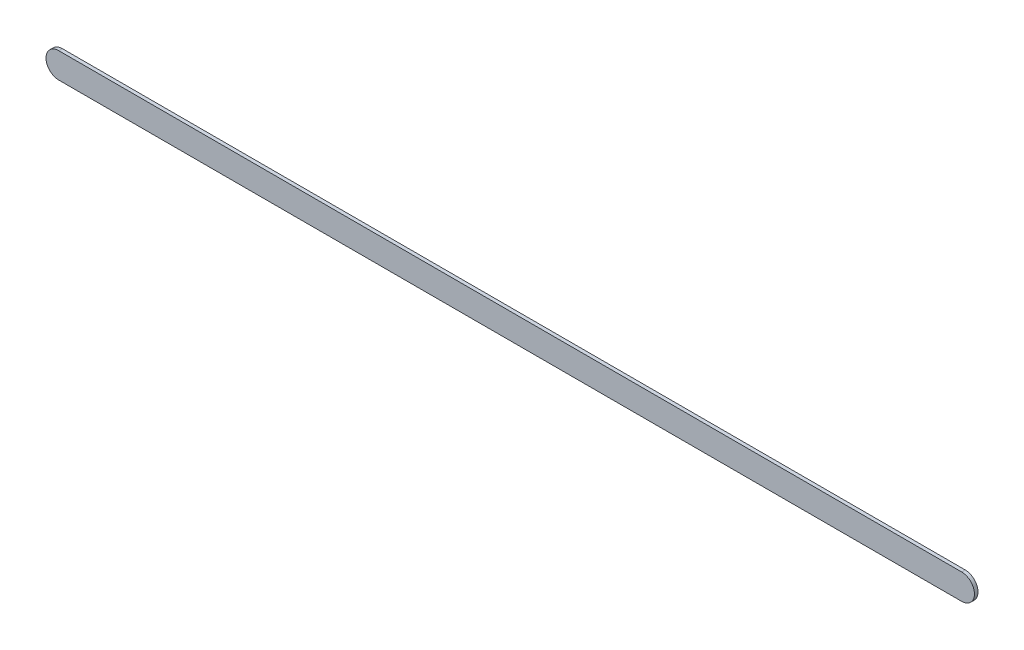
ISO-10303-21;
HEADER;
FILE_DESCRIPTION(('STEP AP214'),'2;1');
FILE_NAME('part.step','',(''),(''),'','','');
FILE_SCHEMA(('AUTOMOTIVE_DESIGN { 1 0 10303 214 1 1 1 1 }'));
ENDSEC;
DATA;
#1=APPLICATION_CONTEXT('core data for automotive mechanical design processes');
#2=APPLICATION_PROTOCOL_DEFINITION('international standard','automotive_design',2000,#1);
#3=PRODUCT_CONTEXT('',#1,'mechanical');
#4=PRODUCT('Part','Part','',(#3));
#5=PRODUCT_RELATED_PRODUCT_CATEGORY('part','',(#4));
#6=PRODUCT_DEFINITION_FORMATION('','',#4);
#7=PRODUCT_DEFINITION_CONTEXT('part definition',#1,'design');
#8=PRODUCT_DEFINITION('design','',#6,#7);
#9=PRODUCT_DEFINITION_SHAPE('','',#8);
#10=(LENGTH_UNIT() NAMED_UNIT(*) SI_UNIT(.MILLI.,.METRE.));
#11=(NAMED_UNIT(*) PLANE_ANGLE_UNIT() SI_UNIT($,.RADIAN.));
#12=(NAMED_UNIT(*) SI_UNIT($,.STERADIAN.) SOLID_ANGLE_UNIT());
#13=UNCERTAINTY_MEASURE_WITH_UNIT(LENGTH_MEASURE(1.E-05),#10,'distance_accuracy_value','');
#14=(GEOMETRIC_REPRESENTATION_CONTEXT(3) GLOBAL_UNCERTAINTY_ASSIGNED_CONTEXT((#13)) GLOBAL_UNIT_ASSIGNED_CONTEXT((#10,
#11,#12)) REPRESENTATION_CONTEXT('',''));
#15=CARTESIAN_POINT('',(0.,0.,0.));
#16=DIRECTION('',(0.,0.,1.));
#17=DIRECTION('',(1.,0.,0.));
#18=AXIS2_PLACEMENT_3D('',#15,#16,#17);
#19=CARTESIAN_POINT('',(76.61697402,94.75997304,0.));
#20=DIRECTION('',(0.,1.,0.));
#21=DIRECTION('',(1.,0.,0.));
#22=AXIS2_PLACEMENT_3D('',#19,#20,#21);
#23=PLANE('',#22);
#24=DIRECTION('',(1.,0.,0.));
#25=VECTOR('',#24,1.);
#26=CARTESIAN_POINT('',(76.61697402,94.75997304,0.03556));
#27=LINE('',#26,#25);
#28=CARTESIAN_POINT('',(76.61697402,94.75997304,0.03556));
#29=VERTEX_POINT('',#28);
#30=CARTESIAN_POINT('',(85.62479192,94.75997304,0.03556));
#31=VERTEX_POINT('',#30);
#32=EDGE_CURVE('E11',#29,#31,#27,.T.);
#33=ORIENTED_EDGE('',*,*,#32,.F.);
#34=DIRECTION('',(0.,0.,1.));
#35=VECTOR('',#34,1.);
#36=CARTESIAN_POINT('',(76.61697402,94.75997304,0.));
#37=LINE('',#36,#35);
#38=CARTESIAN_POINT('',(76.61697402,94.75997304,0.));
#39=VERTEX_POINT('',#38);
#40=EDGE_CURVE('E24',#39,#29,#37,.T.);
#41=ORIENTED_EDGE('',*,*,#40,.F.);
#42=DIRECTION('',(1.,0.,0.));
#43=VECTOR('',#42,1.);
#44=CARTESIAN_POINT('',(76.61697402,94.75997304,0.));
#45=LINE('',#44,#43);
#46=CARTESIAN_POINT('',(85.62479192,94.75997304,0.));
#47=VERTEX_POINT('',#46);
#48=EDGE_CURVE('E75',#39,#47,#45,.T.);
#49=ORIENTED_EDGE('',*,*,#48,.T.);
#50=DIRECTION('',(0.,0.,1.));
#51=VECTOR('',#50,1.);
#52=CARTESIAN_POINT('',(85.62479192,94.75997304,0.));
#53=LINE('',#52,#51);
#54=EDGE_CURVE('E37',#47,#31,#53,.T.);
#55=ORIENTED_EDGE('',*,*,#54,.T.);
#56=EDGE_LOOP('',(#33,#41,#49,#55));
#57=FACE_BOUND('',#56,.T.);
#58=ADVANCED_FACE('F17',(#57),#23,.F.);
#59=CARTESIAN_POINT('',(85.62479192,94.88697304,0.));
#60=DIRECTION('',(0.,0.,-1.));
#61=DIRECTION('',(-1.11896493820492E-13,-1.,0.));
#62=AXIS2_PLACEMENT_3D('',#59,#60,#61);
#63=CYLINDRICAL_SURFACE('',#62,0.126999999999991);
#64=CARTESIAN_POINT('',(85.62479192,94.88697304,0.03556));
#65=DIRECTION('',(0.,0.,1.));
#66=DIRECTION('',(-1.11896493820492E-13,-1.,0.));
#67=AXIS2_PLACEMENT_3D('',#64,#65,#66);
#68=CIRCLE('',#67,0.126999999999991);
#69=CARTESIAN_POINT('',(85.62479192,95.01397304,0.03556));
#70=VERTEX_POINT('',#69);
#71=EDGE_CURVE('E83',#31,#70,#68,.T.);
#72=ORIENTED_EDGE('',*,*,#71,.F.);
#73=ORIENTED_EDGE('',*,*,#54,.F.);
#74=CARTESIAN_POINT('',(85.62479192,94.88697304,0.));
#75=DIRECTION('',(0.,0.,1.));
#76=DIRECTION('',(-1.11896493820492E-13,-1.,0.));
#77=AXIS2_PLACEMENT_3D('',#74,#75,#76);
#78=CIRCLE('',#77,0.126999999999991);
#79=CARTESIAN_POINT('',(85.62479192,95.01397304,0.));
#80=VERTEX_POINT('',#79);
#81=EDGE_CURVE('E81',#47,#80,#78,.T.);
#82=ORIENTED_EDGE('',*,*,#81,.T.);
#83=DIRECTION('',(0.,0.,1.));
#84=VECTOR('',#83,1.);
#85=CARTESIAN_POINT('',(85.62479192,95.01397304,0.));
#86=LINE('',#85,#84);
#87=EDGE_CURVE('E67',#80,#70,#86,.T.);
#88=ORIENTED_EDGE('',*,*,#87,.T.);
#89=EDGE_LOOP('',(#72,#73,#82,#88));
#90=FACE_BOUND('',#89,.T.);
#91=ADVANCED_FACE('F89',(#90),#63,.T.);
#92=CARTESIAN_POINT('',(85.62479192,95.01397304,0.));
#93=DIRECTION('',(0.,-1.,0.));
#94=DIRECTION('',(-1.,0.,0.));
#95=AXIS2_PLACEMENT_3D('',#92,#93,#94);
#96=PLANE('',#95);
#97=DIRECTION('',(-1.,0.,0.));
#98=VECTOR('',#97,1.);
#99=CARTESIAN_POINT('',(85.62479192,95.01397304,0.03556));
#100=LINE('',#99,#98);
#101=CARTESIAN_POINT('',(76.61697402,95.01397304,0.03556));
#102=VERTEX_POINT('',#101);
#103=EDGE_CURVE('E71',#70,#102,#100,.T.);
#104=ORIENTED_EDGE('',*,*,#103,.F.);
#105=ORIENTED_EDGE('',*,*,#87,.F.);
#106=DIRECTION('',(-1.,0.,0.));
#107=VECTOR('',#106,1.);
#108=CARTESIAN_POINT('',(85.62479192,95.01397304,0.));
#109=LINE('',#108,#107);
#110=CARTESIAN_POINT('',(76.61697402,95.01397304,0.));
#111=VERTEX_POINT('',#110);
#112=EDGE_CURVE('E63',#80,#111,#109,.T.);
#113=ORIENTED_EDGE('',*,*,#112,.T.);
#114=DIRECTION('',(0.,0.,1.));
#115=VECTOR('',#114,1.);
#116=CARTESIAN_POINT('',(76.61697402,95.01397304,0.));
#117=LINE('',#116,#115);
#118=EDGE_CURVE('E53',#111,#102,#117,.T.);
#119=ORIENTED_EDGE('',*,*,#118,.T.);
#120=EDGE_LOOP('',(#104,#105,#113,#119));
#121=FACE_BOUND('',#120,.T.);
#122=ADVANCED_FACE('F66',(#121),#96,.F.);
#123=CARTESIAN_POINT('',(76.61697402,94.88697304,0.));
#124=DIRECTION('',(0.,0.,-1.));
#125=DIRECTION('',(0.,1.,0.));
#126=AXIS2_PLACEMENT_3D('',#123,#124,#125);
#127=CYLINDRICAL_SURFACE('',#126,0.126999999999995);
#128=CARTESIAN_POINT('',(76.61697402,94.88697304,0.03556));
#129=DIRECTION('',(0.,0.,1.));
#130=DIRECTION('',(0.,1.,0.));
#131=AXIS2_PLACEMENT_3D('',#128,#129,#130);
#132=CIRCLE('',#131,0.126999999999995);
#133=EDGE_CURVE('E59',#102,#29,#132,.T.);
#134=ORIENTED_EDGE('',*,*,#133,.F.);
#135=ORIENTED_EDGE('',*,*,#118,.F.);
#136=CARTESIAN_POINT('',(76.61697402,94.88697304,0.));
#137=DIRECTION('',(0.,0.,1.));
#138=DIRECTION('',(0.,1.,0.));
#139=AXIS2_PLACEMENT_3D('',#136,#137,#138);
#140=CIRCLE('',#139,0.126999999999995);
#141=EDGE_CURVE('E57',#111,#39,#140,.T.);
#142=ORIENTED_EDGE('',*,*,#141,.T.);
#143=ORIENTED_EDGE('',*,*,#40,.T.);
#144=EDGE_LOOP('',(#134,#135,#142,#143));
#145=FACE_BOUND('',#144,.T.);
#146=ADVANCED_FACE('F55',(#145),#127,.T.);
#147=CARTESIAN_POINT('',(76.61697402,94.75997304,0.));
#148=DIRECTION('',(0.,0.,-1.));
#149=DIRECTION('',(-1.,0.,0.));
#150=AXIS2_PLACEMENT_3D('',#147,#148,#149);
#151=PLANE('',#150);
#152=ORIENTED_EDGE('',*,*,#141,.F.);
#153=ORIENTED_EDGE('',*,*,#112,.F.);
#154=ORIENTED_EDGE('',*,*,#81,.F.);
#155=ORIENTED_EDGE('',*,*,#48,.F.);
#156=EDGE_LOOP('',(#152,#153,#154,#155));
#157=FACE_BOUND('',#156,.T.);
#158=ADVANCED_FACE('F74',(#157),#151,.T.);
#159=CARTESIAN_POINT('',(76.61697402,94.75997304,0.03556));
#160=DIRECTION('',(0.,0.,-1.));
#161=DIRECTION('',(-1.,0.,0.));
#162=AXIS2_PLACEMENT_3D('',#159,#160,#161);
#163=PLANE('',#162);
#164=ORIENTED_EDGE('',*,*,#32,.T.);
#165=ORIENTED_EDGE('',*,*,#71,.T.);
#166=ORIENTED_EDGE('',*,*,#103,.T.);
#167=ORIENTED_EDGE('',*,*,#133,.T.);
#168=EDGE_LOOP('',(#164,#165,#166,#167));
#169=FACE_BOUND('',#168,.T.);
#170=ADVANCED_FACE('F91',(#169),#163,.F.);
#171=CLOSED_SHELL('',(#58,#91,#122,#146,#158,#170));
#172=MANIFOLD_SOLID_BREP('B1',#171);
#173=ADVANCED_BREP_SHAPE_REPRESENTATION('',(#18,#172),#14);
#174=SHAPE_DEFINITION_REPRESENTATION(#9,#173);
ENDSEC;
END-ISO-10303-21;
